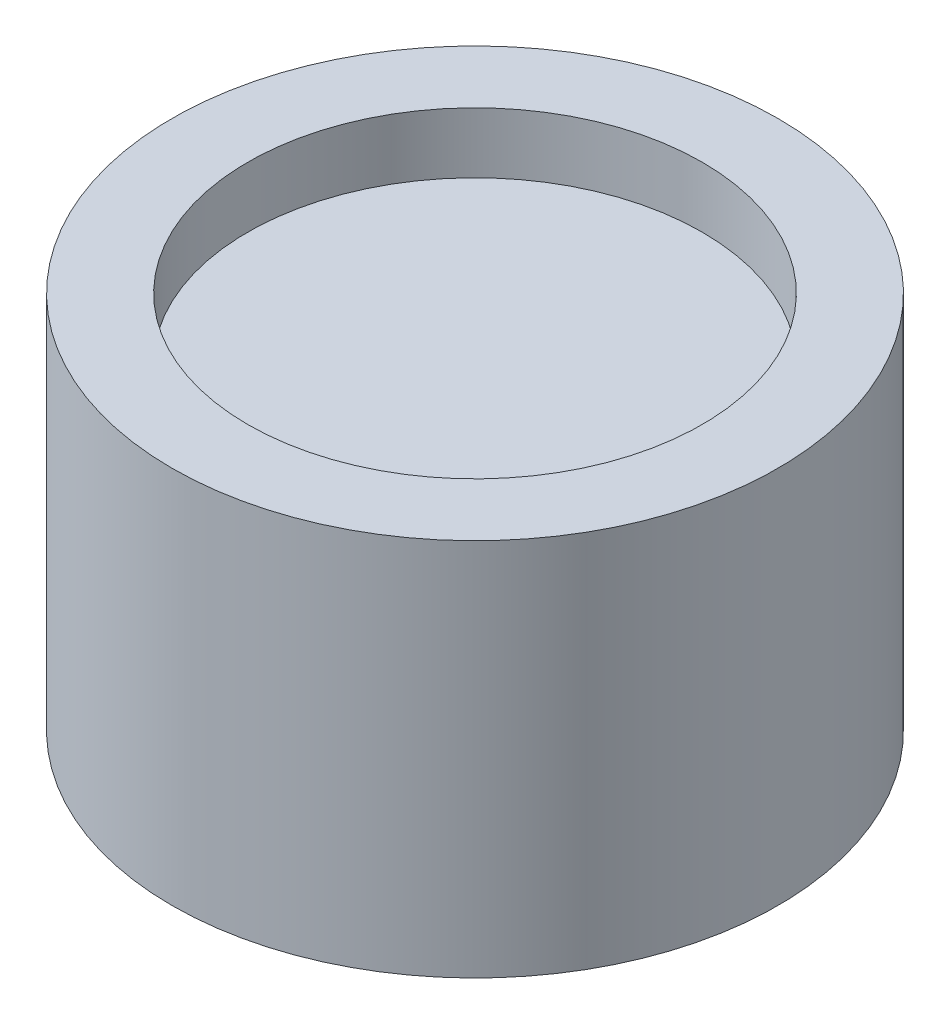
ISO-10303-21;
HEADER;
FILE_DESCRIPTION(('STEP AP214'),'2;1');
FILE_NAME('part.step','',(''),(''),'','','');
FILE_SCHEMA(('AUTOMOTIVE_DESIGN { 1 0 10303 214 1 1 1 1 }'));
ENDSEC;
DATA;
#1=APPLICATION_CONTEXT('core data for automotive mechanical design processes');
#2=APPLICATION_PROTOCOL_DEFINITION('international standard','automotive_design',2000,#1);
#3=PRODUCT_CONTEXT('',#1,'mechanical');
#4=PRODUCT('Part','Part','',(#3));
#5=PRODUCT_RELATED_PRODUCT_CATEGORY('part','',(#4));
#6=PRODUCT_DEFINITION_FORMATION('','',#4);
#7=PRODUCT_DEFINITION_CONTEXT('part definition',#1,'design');
#8=PRODUCT_DEFINITION('design','',#6,#7);
#9=PRODUCT_DEFINITION_SHAPE('','',#8);
#10=(LENGTH_UNIT() NAMED_UNIT(*) SI_UNIT(.MILLI.,.METRE.));
#11=(NAMED_UNIT(*) PLANE_ANGLE_UNIT() SI_UNIT($,.RADIAN.));
#12=(NAMED_UNIT(*) SI_UNIT($,.STERADIAN.) SOLID_ANGLE_UNIT());
#13=UNCERTAINTY_MEASURE_WITH_UNIT(LENGTH_MEASURE(1.E-05),#10,'distance_accuracy_value','');
#14=(GEOMETRIC_REPRESENTATION_CONTEXT(3) GLOBAL_UNCERTAINTY_ASSIGNED_CONTEXT((#13)) GLOBAL_UNIT_ASSIGNED_CONTEXT((#10,
#11,#12)) REPRESENTATION_CONTEXT('',''));
#15=CARTESIAN_POINT('',(0.,0.,0.));
#16=DIRECTION('',(0.,0.,1.));
#17=DIRECTION('',(1.,0.,0.));
#18=AXIS2_PLACEMENT_3D('',#15,#16,#17);
#19=CARTESIAN_POINT('',(150.,210.,0.));
#20=DIRECTION('',(0.,1.,0.));
#21=DIRECTION('',(0.,0.,1.));
#22=AXIS2_PLACEMENT_3D('',#19,#20,#21);
#23=PLANE('',#22);
#24=CARTESIAN_POINT('',(0.,210.,0.));
#25=DIRECTION('',(0.,-1.,0.));
#26=DIRECTION('',(0.,0.,-1.));
#27=AXIS2_PLACEMENT_3D('',#24,#25,#26);
#28=CIRCLE('',#27,150.);
#29=CARTESIAN_POINT('',(0.,210.,-150.));
#30=VERTEX_POINT('',#29);
#31=EDGE_CURVE('E10',#30,#30,#28,.T.);
#32=ORIENTED_EDGE('',*,*,#31,.F.);
#33=EDGE_LOOP('',(#32));
#34=FACE_BOUND('',#33,.T.);
#35=ADVANCED_FACE('F30',(#34),#23,.T.);
#36=CARTESIAN_POINT('',(0.,0.,0.));
#37=DIRECTION('',(0.,-1.,0.));
#38=DIRECTION('',(0.,0.,-1.));
#39=AXIS2_PLACEMENT_3D('',#36,#37,#38);
#40=CYLINDRICAL_SURFACE('',#39,150.);
#41=ORIENTED_EDGE('',*,*,#31,.T.);
#42=EDGE_LOOP('',(#41));
#43=FACE_BOUND('',#42,.T.);
#44=CARTESIAN_POINT('',(0.,250.,0.));
#45=DIRECTION('',(0.,-1.,0.));
#46=DIRECTION('',(0.,0.,-1.));
#47=AXIS2_PLACEMENT_3D('',#44,#45,#46);
#48=CIRCLE('',#47,150.);
#49=CARTESIAN_POINT('',(0.,250.,-150.));
#50=VERTEX_POINT('',#49);
#51=EDGE_CURVE('E36',#50,#50,#48,.T.);
#52=ORIENTED_EDGE('',*,*,#51,.F.);
#53=EDGE_LOOP('',(#52));
#54=FACE_BOUND('',#53,.T.);
#55=ADVANCED_FACE('F104',(#43,#54),#40,.F.);
#56=CARTESIAN_POINT('',(150.,250.,0.));
#57=DIRECTION('',(0.,1.,0.));
#58=DIRECTION('',(0.,0.,1.));
#59=AXIS2_PLACEMENT_3D('',#56,#57,#58);
#60=PLANE('',#59);
#61=ORIENTED_EDGE('',*,*,#51,.T.);
#62=EDGE_LOOP('',(#61));
#63=FACE_BOUND('',#62,.T.);
#64=CARTESIAN_POINT('',(0.,250.,0.));
#65=DIRECTION('',(0.,-1.,0.));
#66=DIRECTION('',(0.,0.,-1.));
#67=AXIS2_PLACEMENT_3D('',#64,#65,#66);
#68=CIRCLE('',#67,200.);
#69=CARTESIAN_POINT('',(0.,250.,-200.));
#70=VERTEX_POINT('',#69);
#71=EDGE_CURVE('E40',#70,#70,#68,.T.);
#72=ORIENTED_EDGE('',*,*,#71,.F.);
#73=EDGE_LOOP('',(#72));
#74=FACE_BOUND('',#73,.T.);
#75=ADVANCED_FACE('F98',(#63,#74),#60,.T.);
#76=CARTESIAN_POINT('',(0.,0.,0.));
#77=DIRECTION('',(0.,-1.,0.));
#78=DIRECTION('',(0.,0.,-1.));
#79=AXIS2_PLACEMENT_3D('',#76,#77,#78);
#80=CYLINDRICAL_SURFACE('',#79,200.);
#81=ORIENTED_EDGE('',*,*,#71,.T.);
#82=EDGE_LOOP('',(#81));
#83=FACE_BOUND('',#82,.T.);
#84=CARTESIAN_POINT('',(0.,0.,0.));
#85=DIRECTION('',(0.,-1.,0.));
#86=DIRECTION('',(0.,0.,-1.));
#87=AXIS2_PLACEMENT_3D('',#84,#85,#86);
#88=CIRCLE('',#87,200.);
#89=CARTESIAN_POINT('',(0.,0.,-200.));
#90=VERTEX_POINT('',#89);
#91=EDGE_CURVE('E44',#90,#90,#88,.T.);
#92=ORIENTED_EDGE('',*,*,#91,.F.);
#93=EDGE_LOOP('',(#92));
#94=FACE_BOUND('',#93,.T.);
#95=ADVANCED_FACE('F87',(#83,#94),#80,.T.);
#96=CARTESIAN_POINT('',(200.,0.,0.));
#97=DIRECTION('',(0.,-1.,0.));
#98=DIRECTION('',(0.,0.,-1.));
#99=AXIS2_PLACEMENT_3D('',#96,#97,#98);
#100=PLANE('',#99);
#101=CARTESIAN_POINT('',(-71.,0.,-55.));
#102=DIRECTION('',(0.,-1.,0.));
#103=DIRECTION('',(0.,0.,-1.));
#104=AXIS2_PLACEMENT_3D('',#101,#102,#103);
#105=CIRCLE('',#104,8.);
#106=CARTESIAN_POINT('',(-71.,0.,-63.));
#107=VERTEX_POINT('',#106);
#108=EDGE_CURVE('E68',#107,#107,#105,.T.);
#109=ORIENTED_EDGE('',*,*,#108,.F.);
#110=EDGE_LOOP('',(#109));
#111=FACE_BOUND('',#110,.T.);
#112=CARTESIAN_POINT('',(71.,0.,-55.));
#113=DIRECTION('',(0.,-1.,0.));
#114=DIRECTION('',(0.,0.,-1.));
#115=AXIS2_PLACEMENT_3D('',#112,#113,#114);
#116=CIRCLE('',#115,8.00000000000003);
#117=CARTESIAN_POINT('',(71.,0.,-63.));
#118=VERTEX_POINT('',#117);
#119=EDGE_CURVE('E62',#118,#118,#116,.T.);
#120=ORIENTED_EDGE('',*,*,#119,.F.);
#121=EDGE_LOOP('',(#120));
#122=FACE_BOUND('',#121,.T.);
#123=CARTESIAN_POINT('',(71.,0.,55.));
#124=DIRECTION('',(0.,-1.,0.));
#125=DIRECTION('',(0.,0.,-1.));
#126=AXIS2_PLACEMENT_3D('',#123,#124,#125);
#127=CIRCLE('',#126,8.00000000000003);
#128=CARTESIAN_POINT('',(71.,0.,47.));
#129=VERTEX_POINT('',#128);
#130=EDGE_CURVE('E56',#129,#129,#127,.T.);
#131=ORIENTED_EDGE('',*,*,#130,.F.);
#132=EDGE_LOOP('',(#131));
#133=FACE_BOUND('',#132,.T.);
#134=CARTESIAN_POINT('',(-71.,0.,55.));
#135=DIRECTION('',(0.,-1.,0.));
#136=DIRECTION('',(0.,0.,-1.));
#137=AXIS2_PLACEMENT_3D('',#134,#135,#136);
#138=CIRCLE('',#137,8.);
#139=CARTESIAN_POINT('',(-71.,0.,47.));
#140=VERTEX_POINT('',#139);
#141=EDGE_CURVE('E50',#140,#140,#138,.T.);
#142=ORIENTED_EDGE('',*,*,#141,.F.);
#143=EDGE_LOOP('',(#142));
#144=FACE_BOUND('',#143,.T.);
#145=ORIENTED_EDGE('',*,*,#91,.T.);
#146=EDGE_LOOP('',(#145));
#147=FACE_BOUND('',#146,.T.);
#148=ADVANCED_FACE('F83',(#111,#122,#133,#144,#147),#100,.T.);
#149=CARTESIAN_POINT('',(-71.,10.,55.));
#150=DIRECTION('',(0.,-1.,0.));
#151=DIRECTION('',(0.,0.,-1.));
#152=AXIS2_PLACEMENT_3D('',#149,#150,#151);
#153=CYLINDRICAL_SURFACE('',#152,8.);
#154=CARTESIAN_POINT('',(-71.,10.,55.));
#155=DIRECTION('',(0.,-1.,0.));
#156=DIRECTION('',(0.,0.,-1.));
#157=AXIS2_PLACEMENT_3D('',#154,#155,#156);
#158=CIRCLE('',#157,8.);
#159=CARTESIAN_POINT('',(-71.,10.,47.));
#160=VERTEX_POINT('',#159);
#161=EDGE_CURVE('E49',#160,#160,#158,.T.);
#162=ORIENTED_EDGE('',*,*,#161,.F.);
#163=EDGE_LOOP('',(#162));
#164=FACE_BOUND('',#163,.T.);
#165=ORIENTED_EDGE('',*,*,#141,.T.);
#166=EDGE_LOOP('',(#165));
#167=FACE_BOUND('',#166,.T.);
#168=ADVANCED_FACE('F86',(#164,#167),#153,.F.);
#169=CARTESIAN_POINT('',(-71.,10.,55.));
#170=DIRECTION('',(0.,-1.,0.));
#171=DIRECTION('',(0.,0.,-1.));
#172=AXIS2_PLACEMENT_3D('',#169,#170,#171);
#173=PLANE('',#172);
#174=ORIENTED_EDGE('',*,*,#161,.T.);
#175=EDGE_LOOP('',(#174));
#176=FACE_BOUND('',#175,.T.);
#177=ADVANCED_FACE('F137',(#176),#173,.T.);
#178=CARTESIAN_POINT('',(71.,10.,55.));
#179=DIRECTION('',(0.,-1.,0.));
#180=DIRECTION('',(0.,0.,-1.));
#181=AXIS2_PLACEMENT_3D('',#178,#179,#180);
#182=CYLINDRICAL_SURFACE('',#181,8.00000000000003);
#183=CARTESIAN_POINT('',(71.,10.,55.));
#184=DIRECTION('',(0.,-1.,0.));
#185=DIRECTION('',(0.,0.,-1.));
#186=AXIS2_PLACEMENT_3D('',#183,#184,#185);
#187=CIRCLE('',#186,8.00000000000003);
#188=CARTESIAN_POINT('',(71.,10.,47.));
#189=VERTEX_POINT('',#188);
#190=EDGE_CURVE('E53',#189,#189,#187,.T.);
#191=ORIENTED_EDGE('',*,*,#190,.F.);
#192=EDGE_LOOP('',(#191));
#193=FACE_BOUND('',#192,.T.);
#194=ORIENTED_EDGE('',*,*,#130,.T.);
#195=EDGE_LOOP('',(#194));
#196=FACE_BOUND('',#195,.T.);
#197=ADVANCED_FACE('F147',(#193,#196),#182,.F.);
#198=CARTESIAN_POINT('',(71.,10.,55.));
#199=DIRECTION('',(0.,-1.,0.));
#200=DIRECTION('',(0.,0.,-1.));
#201=AXIS2_PLACEMENT_3D('',#198,#199,#200);
#202=PLANE('',#201);
#203=ORIENTED_EDGE('',*,*,#190,.T.);
#204=EDGE_LOOP('',(#203));
#205=FACE_BOUND('',#204,.T.);
#206=ADVANCED_FACE('F157',(#205),#202,.T.);
#207=CARTESIAN_POINT('',(71.,10.,-55.));
#208=DIRECTION('',(0.,-1.,0.));
#209=DIRECTION('',(0.,0.,-1.));
#210=AXIS2_PLACEMENT_3D('',#207,#208,#209);
#211=CYLINDRICAL_SURFACE('',#210,8.00000000000003);
#212=CARTESIAN_POINT('',(71.,10.,-55.));
#213=DIRECTION('',(0.,-1.,0.));
#214=DIRECTION('',(0.,0.,-1.));
#215=AXIS2_PLACEMENT_3D('',#212,#213,#214);
#216=CIRCLE('',#215,8.00000000000003);
#217=CARTESIAN_POINT('',(71.,10.,-63.));
#218=VERTEX_POINT('',#217);
#219=EDGE_CURVE('E59',#218,#218,#216,.T.);
#220=ORIENTED_EDGE('',*,*,#219,.F.);
#221=EDGE_LOOP('',(#220));
#222=FACE_BOUND('',#221,.T.);
#223=ORIENTED_EDGE('',*,*,#119,.T.);
#224=EDGE_LOOP('',(#223));
#225=FACE_BOUND('',#224,.T.);
#226=ADVANCED_FACE('F167',(#222,#225),#211,.F.);
#227=CARTESIAN_POINT('',(71.,10.,-55.));
#228=DIRECTION('',(0.,-1.,0.));
#229=DIRECTION('',(0.,0.,-1.));
#230=AXIS2_PLACEMENT_3D('',#227,#228,#229);
#231=PLANE('',#230);
#232=ORIENTED_EDGE('',*,*,#219,.T.);
#233=EDGE_LOOP('',(#232));
#234=FACE_BOUND('',#233,.T.);
#235=ADVANCED_FACE('F79',(#234),#231,.T.);
#236=CARTESIAN_POINT('',(-71.,10.,-55.));
#237=DIRECTION('',(0.,-1.,0.));
#238=DIRECTION('',(0.,0.,-1.));
#239=AXIS2_PLACEMENT_3D('',#236,#237,#238);
#240=CYLINDRICAL_SURFACE('',#239,8.);
#241=CARTESIAN_POINT('',(-71.,10.,-55.));
#242=DIRECTION('',(0.,-1.,0.));
#243=DIRECTION('',(0.,0.,-1.));
#244=AXIS2_PLACEMENT_3D('',#241,#242,#243);
#245=CIRCLE('',#244,8.);
#246=CARTESIAN_POINT('',(-71.,10.,-63.));
#247=VERTEX_POINT('',#246);
#248=EDGE_CURVE('E65',#247,#247,#245,.T.);
#249=ORIENTED_EDGE('',*,*,#248,.F.);
#250=EDGE_LOOP('',(#249));
#251=FACE_BOUND('',#250,.T.);
#252=ORIENTED_EDGE('',*,*,#108,.T.);
#253=EDGE_LOOP('',(#252));
#254=FACE_BOUND('',#253,.T.);
#255=ADVANCED_FACE('F76',(#251,#254),#240,.F.);
#256=CARTESIAN_POINT('',(-71.,10.,-55.));
#257=DIRECTION('',(0.,-1.,0.));
#258=DIRECTION('',(0.,0.,-1.));
#259=AXIS2_PLACEMENT_3D('',#256,#257,#258);
#260=PLANE('',#259);
#261=ORIENTED_EDGE('',*,*,#248,.T.);
#262=EDGE_LOOP('',(#261));
#263=FACE_BOUND('',#262,.T.);
#264=ADVANCED_FACE('F74',(#263),#260,.T.);
#265=CLOSED_SHELL('',(#35,#55,#75,#95,#148,#168,#177,#197,#206,#226,#235,#255,#264));
#266=MANIFOLD_SOLID_BREP('B2',#265);
#267=ADVANCED_BREP_SHAPE_REPRESENTATION('',(#18,#266),#14);
#268=SHAPE_DEFINITION_REPRESENTATION(#9,#267);
ENDSEC;
END-ISO-10303-21;
